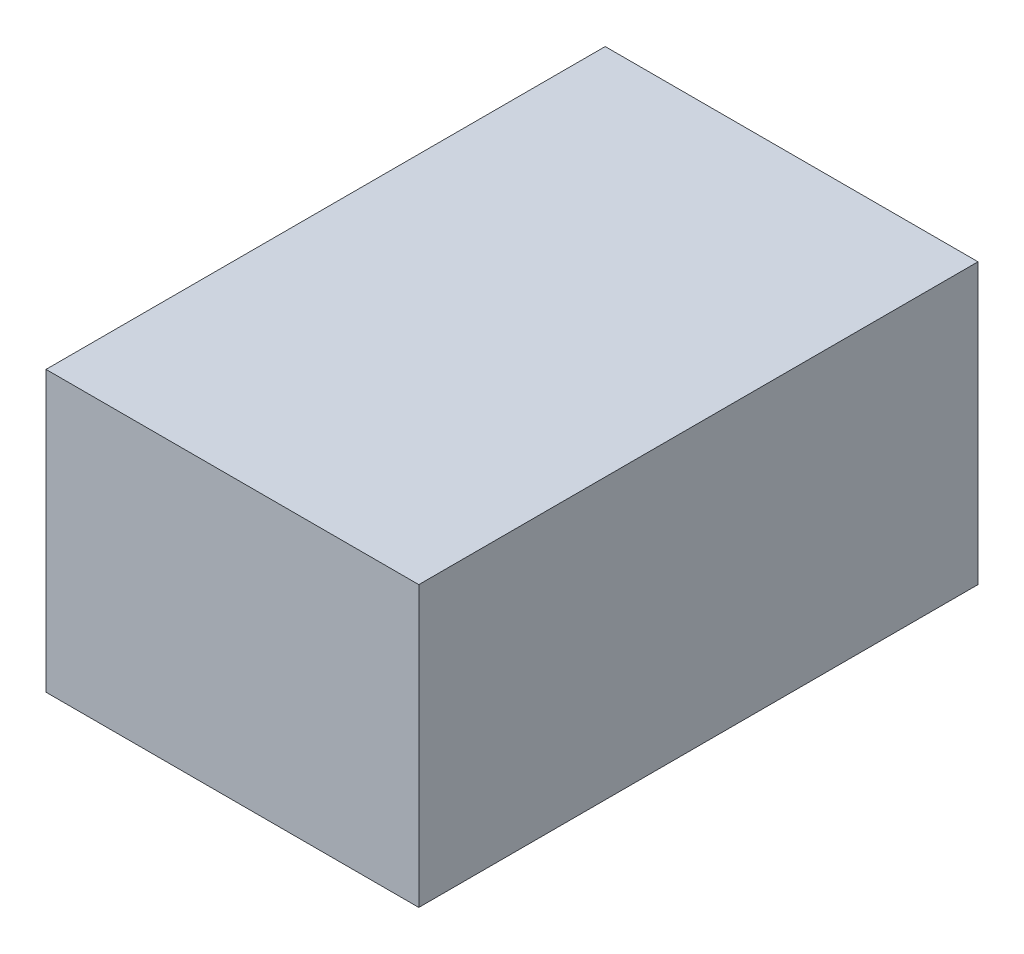
ISO-10303-21;
HEADER;
FILE_DESCRIPTION(('STEP AP214'),'2;1');
FILE_NAME('part.step','',(''),(''),'','','');
FILE_SCHEMA(('AUTOMOTIVE_DESIGN { 1 0 10303 214 1 1 1 1 }'));
ENDSEC;
DATA;
#1=APPLICATION_CONTEXT('core data for automotive mechanical design processes');
#2=APPLICATION_PROTOCOL_DEFINITION('international standard','automotive_design',2000,#1);
#3=PRODUCT_CONTEXT('',#1,'mechanical');
#4=PRODUCT('Part','Part','',(#3));
#5=PRODUCT_RELATED_PRODUCT_CATEGORY('part','',(#4));
#6=PRODUCT_DEFINITION_FORMATION('','',#4);
#7=PRODUCT_DEFINITION_CONTEXT('part definition',#1,'design');
#8=PRODUCT_DEFINITION('design','',#6,#7);
#9=PRODUCT_DEFINITION_SHAPE('','',#8);
#10=(LENGTH_UNIT() NAMED_UNIT(*) SI_UNIT(.MILLI.,.METRE.));
#11=(NAMED_UNIT(*) PLANE_ANGLE_UNIT() SI_UNIT($,.RADIAN.));
#12=(NAMED_UNIT(*) SI_UNIT($,.STERADIAN.) SOLID_ANGLE_UNIT());
#13=UNCERTAINTY_MEASURE_WITH_UNIT(LENGTH_MEASURE(1.E-05),#10,'distance_accuracy_value','');
#14=(GEOMETRIC_REPRESENTATION_CONTEXT(3) GLOBAL_UNCERTAINTY_ASSIGNED_CONTEXT((#13)) GLOBAL_UNIT_ASSIGNED_CONTEXT((#10,
#11,#12)) REPRESENTATION_CONTEXT('',''));
#15=CARTESIAN_POINT('',(0.,0.,0.));
#16=DIRECTION('',(0.,0.,1.));
#17=DIRECTION('',(1.,0.,0.));
#18=AXIS2_PLACEMENT_3D('',#15,#16,#17);
#19=CARTESIAN_POINT('',(0.,0.,152.4));
#20=DIRECTION('',(1.,0.,0.));
#21=DIRECTION('',(0.,0.,-1.));
#22=AXIS2_PLACEMENT_3D('',#19,#20,#21);
#23=PLANE('',#22);
#24=DIRECTION('',(0.,-1.,0.));
#25=VECTOR('',#24,1.);
#26=CARTESIAN_POINT('',(0.,0.,0.));
#27=LINE('',#26,#25);
#28=CARTESIAN_POINT('',(0.,76.2,0.));
#29=VERTEX_POINT('',#28);
#30=CARTESIAN_POINT('',(0.,0.,0.));
#31=VERTEX_POINT('',#30);
#32=EDGE_CURVE('E100',#29,#31,#27,.T.);
#33=ORIENTED_EDGE('',*,*,#32,.T.);
#34=DIRECTION('',(0.,0.,-1.));
#35=VECTOR('',#34,1.);
#36=CARTESIAN_POINT('',(0.,0.,152.4));
#37=LINE('',#36,#35);
#38=CARTESIAN_POINT('',(0.,0.,152.4));
#39=VERTEX_POINT('',#38);
#40=EDGE_CURVE('E11',#39,#31,#37,.T.);
#41=ORIENTED_EDGE('',*,*,#40,.F.);
#42=DIRECTION('',(0.,-1.,0.));
#43=VECTOR('',#42,1.);
#44=CARTESIAN_POINT('',(0.,0.,152.4));
#45=LINE('',#44,#43);
#46=CARTESIAN_POINT('',(0.,76.2,152.4));
#47=VERTEX_POINT('',#46);
#48=EDGE_CURVE('E88',#47,#39,#45,.T.);
#49=ORIENTED_EDGE('',*,*,#48,.F.);
#50=DIRECTION('',(0.,0.,-1.));
#51=VECTOR('',#50,1.);
#52=CARTESIAN_POINT('',(0.,76.2,152.4));
#53=LINE('',#52,#51);
#54=EDGE_CURVE('E96',#47,#29,#53,.T.);
#55=ORIENTED_EDGE('',*,*,#54,.T.);
#56=EDGE_LOOP('',(#33,#41,#49,#55));
#57=FACE_BOUND('',#56,.T.);
#58=ADVANCED_FACE('F37',(#57),#23,.F.);
#59=CARTESIAN_POINT('',(0.,0.,152.4));
#60=DIRECTION('',(0.,1.,0.));
#61=DIRECTION('',(0.,0.,1.));
#62=AXIS2_PLACEMENT_3D('',#59,#60,#61);
#63=PLANE('',#62);
#64=DIRECTION('',(1.,0.,0.));
#65=VECTOR('',#64,1.);
#66=CARTESIAN_POINT('',(0.,0.,0.));
#67=LINE('',#66,#65);
#68=CARTESIAN_POINT('',(101.6,0.,0.));
#69=VERTEX_POINT('',#68);
#70=EDGE_CURVE('E92',#31,#69,#67,.T.);
#71=ORIENTED_EDGE('',*,*,#70,.T.);
#72=DIRECTION('',(0.,0.,-1.));
#73=VECTOR('',#72,1.);
#74=CARTESIAN_POINT('',(101.6,0.,152.4));
#75=LINE('',#74,#73);
#76=CARTESIAN_POINT('',(101.6,0.,152.4));
#77=VERTEX_POINT('',#76);
#78=EDGE_CURVE('E45',#77,#69,#75,.T.);
#79=ORIENTED_EDGE('',*,*,#78,.F.);
#80=DIRECTION('',(1.,0.,0.));
#81=VECTOR('',#80,1.);
#82=CARTESIAN_POINT('',(0.,0.,152.4));
#83=LINE('',#82,#81);
#84=EDGE_CURVE('E83',#39,#77,#83,.T.);
#85=ORIENTED_EDGE('',*,*,#84,.F.);
#86=ORIENTED_EDGE('',*,*,#40,.T.);
#87=EDGE_LOOP('',(#71,#79,#85,#86));
#88=FACE_BOUND('',#87,.T.);
#89=ADVANCED_FACE('F91',(#88),#63,.F.);
#90=CARTESIAN_POINT('',(101.6,0.,152.4));
#91=DIRECTION('',(-1.,0.,0.));
#92=DIRECTION('',(0.,0.,1.));
#93=AXIS2_PLACEMENT_3D('',#90,#91,#92);
#94=PLANE('',#93);
#95=DIRECTION('',(0.,1.,0.));
#96=VECTOR('',#95,1.);
#97=CARTESIAN_POINT('',(101.6,0.,0.));
#98=LINE('',#97,#96);
#99=CARTESIAN_POINT('',(101.6,76.2,0.));
#100=VERTEX_POINT('',#99);
#101=EDGE_CURVE('E70',#69,#100,#98,.T.);
#102=ORIENTED_EDGE('',*,*,#101,.T.);
#103=DIRECTION('',(0.,0.,-1.));
#104=VECTOR('',#103,1.);
#105=CARTESIAN_POINT('',(101.6,76.2,152.4));
#106=LINE('',#105,#104);
#107=CARTESIAN_POINT('',(101.6,76.2,152.4));
#108=VERTEX_POINT('',#107);
#109=EDGE_CURVE('E93',#108,#100,#106,.T.);
#110=ORIENTED_EDGE('',*,*,#109,.F.);
#111=DIRECTION('',(0.,1.,0.));
#112=VECTOR('',#111,1.);
#113=CARTESIAN_POINT('',(101.6,0.,152.4));
#114=LINE('',#113,#112);
#115=EDGE_CURVE('E86',#77,#108,#114,.T.);
#116=ORIENTED_EDGE('',*,*,#115,.F.);
#117=ORIENTED_EDGE('',*,*,#78,.T.);
#118=EDGE_LOOP('',(#102,#110,#116,#117));
#119=FACE_BOUND('',#118,.T.);
#120=ADVANCED_FACE('F94',(#119),#94,.F.);
#121=CARTESIAN_POINT('',(0.,76.2,152.4));
#122=DIRECTION('',(0.,-1.,0.));
#123=DIRECTION('',(0.,0.,-1.));
#124=AXIS2_PLACEMENT_3D('',#121,#122,#123);
#125=PLANE('',#124);
#126=DIRECTION('',(-1.,0.,0.));
#127=VECTOR('',#126,1.);
#128=CARTESIAN_POINT('',(0.,76.2,0.));
#129=LINE('',#128,#127);
#130=EDGE_CURVE('E76',#100,#29,#129,.T.);
#131=ORIENTED_EDGE('',*,*,#130,.T.);
#132=ORIENTED_EDGE('',*,*,#54,.F.);
#133=DIRECTION('',(-1.,0.,0.));
#134=VECTOR('',#133,1.);
#135=CARTESIAN_POINT('',(0.,76.2,152.4));
#136=LINE('',#135,#134);
#137=EDGE_CURVE('E53',#108,#47,#136,.T.);
#138=ORIENTED_EDGE('',*,*,#137,.F.);
#139=ORIENTED_EDGE('',*,*,#109,.T.);
#140=EDGE_LOOP('',(#131,#132,#138,#139));
#141=FACE_BOUND('',#140,.T.);
#142=ADVANCED_FACE('F107',(#141),#125,.F.);
#143=CARTESIAN_POINT('',(0.,0.,152.4));
#144=DIRECTION('',(0.,0.,-1.));
#145=DIRECTION('',(-1.,0.,0.));
#146=AXIS2_PLACEMENT_3D('',#143,#144,#145);
#147=PLANE('',#146);
#148=ORIENTED_EDGE('',*,*,#48,.T.);
#149=ORIENTED_EDGE('',*,*,#84,.T.);
#150=ORIENTED_EDGE('',*,*,#115,.T.);
#151=ORIENTED_EDGE('',*,*,#137,.T.);
#152=EDGE_LOOP('',(#148,#149,#150,#151));
#153=FACE_BOUND('',#152,.T.);
#154=ADVANCED_FACE('F84',(#153),#147,.F.);
#155=CARTESIAN_POINT('',(0.,0.,0.));
#156=DIRECTION('',(0.,0.,-1.));
#157=DIRECTION('',(-1.,0.,0.));
#158=AXIS2_PLACEMENT_3D('',#155,#156,#157);
#159=PLANE('',#158);
#160=ORIENTED_EDGE('',*,*,#32,.F.);
#161=ORIENTED_EDGE('',*,*,#130,.F.);
#162=ORIENTED_EDGE('',*,*,#101,.F.);
#163=ORIENTED_EDGE('',*,*,#70,.F.);
#164=EDGE_LOOP('',(#160,#161,#162,#163));
#165=FACE_BOUND('',#164,.T.);
#166=ADVANCED_FACE('F110',(#165),#159,.T.);
#167=CLOSED_SHELL('',(#58,#89,#120,#142,#154,#166));
#168=MANIFOLD_SOLID_BREP('B2',#167);
#169=ADVANCED_BREP_SHAPE_REPRESENTATION('',(#18,#168),#14);
#170=SHAPE_DEFINITION_REPRESENTATION(#9,#169);
ENDSEC;
END-ISO-10303-21;
